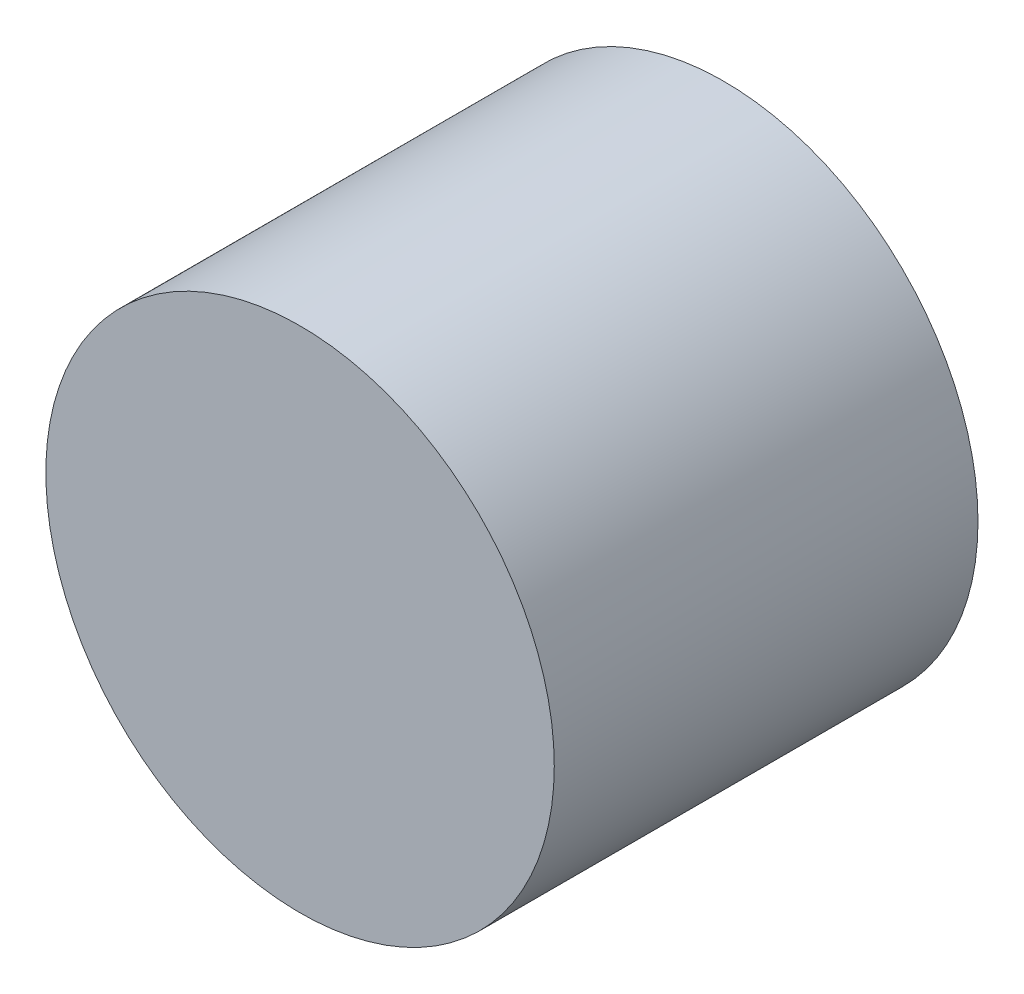
ISO-10303-21;
HEADER;
FILE_DESCRIPTION(('STEP AP214'),'2;1');
FILE_NAME('part.step','',(''),(''),'','','');
FILE_SCHEMA(('AUTOMOTIVE_DESIGN { 1 0 10303 214 1 1 1 1 }'));
ENDSEC;
DATA;
#1=APPLICATION_CONTEXT('core data for automotive mechanical design processes');
#2=APPLICATION_PROTOCOL_DEFINITION('international standard','automotive_design',2000,#1);
#3=PRODUCT_CONTEXT('',#1,'mechanical');
#4=PRODUCT('Part','Part','',(#3));
#5=PRODUCT_RELATED_PRODUCT_CATEGORY('part','',(#4));
#6=PRODUCT_DEFINITION_FORMATION('','',#4);
#7=PRODUCT_DEFINITION_CONTEXT('part definition',#1,'design');
#8=PRODUCT_DEFINITION('design','',#6,#7);
#9=PRODUCT_DEFINITION_SHAPE('','',#8);
#10=(LENGTH_UNIT() NAMED_UNIT(*) SI_UNIT(.MILLI.,.METRE.));
#11=(NAMED_UNIT(*) PLANE_ANGLE_UNIT() SI_UNIT($,.RADIAN.));
#12=(NAMED_UNIT(*) SI_UNIT($,.STERADIAN.) SOLID_ANGLE_UNIT());
#13=UNCERTAINTY_MEASURE_WITH_UNIT(LENGTH_MEASURE(1.E-05),#10,'distance_accuracy_value','');
#14=(GEOMETRIC_REPRESENTATION_CONTEXT(3) GLOBAL_UNCERTAINTY_ASSIGNED_CONTEXT((#13)) GLOBAL_UNIT_ASSIGNED_CONTEXT((#10,
#11,#12)) REPRESENTATION_CONTEXT('',''));
#15=CARTESIAN_POINT('',(0.,0.,0.));
#16=DIRECTION('',(0.,0.,1.));
#17=DIRECTION('',(1.,0.,0.));
#18=AXIS2_PLACEMENT_3D('',#15,#16,#17);
#19=CARTESIAN_POINT('',(0.,0.,31.75));
#20=DIRECTION('',(0.,0.,-1.));
#21=DIRECTION('',(-1.,0.,0.));
#22=AXIS2_PLACEMENT_3D('',#19,#20,#21);
#23=CYLINDRICAL_SURFACE('',#22,19.05);
#24=CARTESIAN_POINT('',(0.,0.,31.75));
#25=DIRECTION('',(0.,0.,1.));
#26=DIRECTION('',(1.,0.,0.));
#27=AXIS2_PLACEMENT_3D('',#24,#25,#26);
#28=CIRCLE('',#27,19.05);
#29=CARTESIAN_POINT('',(19.05,0.,31.75));
#30=VERTEX_POINT('',#29);
#31=EDGE_CURVE('E10',#30,#30,#28,.T.);
#32=ORIENTED_EDGE('',*,*,#31,.F.);
#33=EDGE_LOOP('',(#32));
#34=FACE_BOUND('',#33,.T.);
#35=CARTESIAN_POINT('',(0.,0.,0.));
#36=DIRECTION('',(0.,0.,1.));
#37=DIRECTION('',(1.,0.,0.));
#38=AXIS2_PLACEMENT_3D('',#35,#36,#37);
#39=CIRCLE('',#38,19.05);
#40=CARTESIAN_POINT('',(19.05,0.,0.));
#41=VERTEX_POINT('',#40);
#42=EDGE_CURVE('E38',#41,#41,#39,.T.);
#43=ORIENTED_EDGE('',*,*,#42,.T.);
#44=EDGE_LOOP('',(#43));
#45=FACE_BOUND('',#44,.T.);
#46=ADVANCED_FACE('F35',(#34,#45),#23,.T.);
#47=CARTESIAN_POINT('',(0.,0.,31.75));
#48=DIRECTION('',(0.,0.,1.));
#49=DIRECTION('',(1.,0.,0.));
#50=AXIS2_PLACEMENT_3D('',#47,#48,#49);
#51=PLANE('',#50);
#52=ORIENTED_EDGE('',*,*,#31,.T.);
#53=EDGE_LOOP('',(#52));
#54=FACE_BOUND('',#53,.T.);
#55=ADVANCED_FACE('F50',(#54),#51,.T.);
#56=CARTESIAN_POINT('',(0.,0.,0.));
#57=DIRECTION('',(0.,0.,1.));
#58=DIRECTION('',(1.,0.,0.));
#59=AXIS2_PLACEMENT_3D('',#56,#57,#58);
#60=PLANE('',#59);
#61=ORIENTED_EDGE('',*,*,#42,.F.);
#62=EDGE_LOOP('',(#61));
#63=FACE_BOUND('',#62,.T.);
#64=ADVANCED_FACE('F48',(#63),#60,.F.);
#65=CLOSED_SHELL('',(#46,#55,#64));
#66=MANIFOLD_SOLID_BREP('B2',#65);
#67=ADVANCED_BREP_SHAPE_REPRESENTATION('',(#18,#66),#14);
#68=SHAPE_DEFINITION_REPRESENTATION(#9,#67);
ENDSEC;
END-ISO-10303-21;
